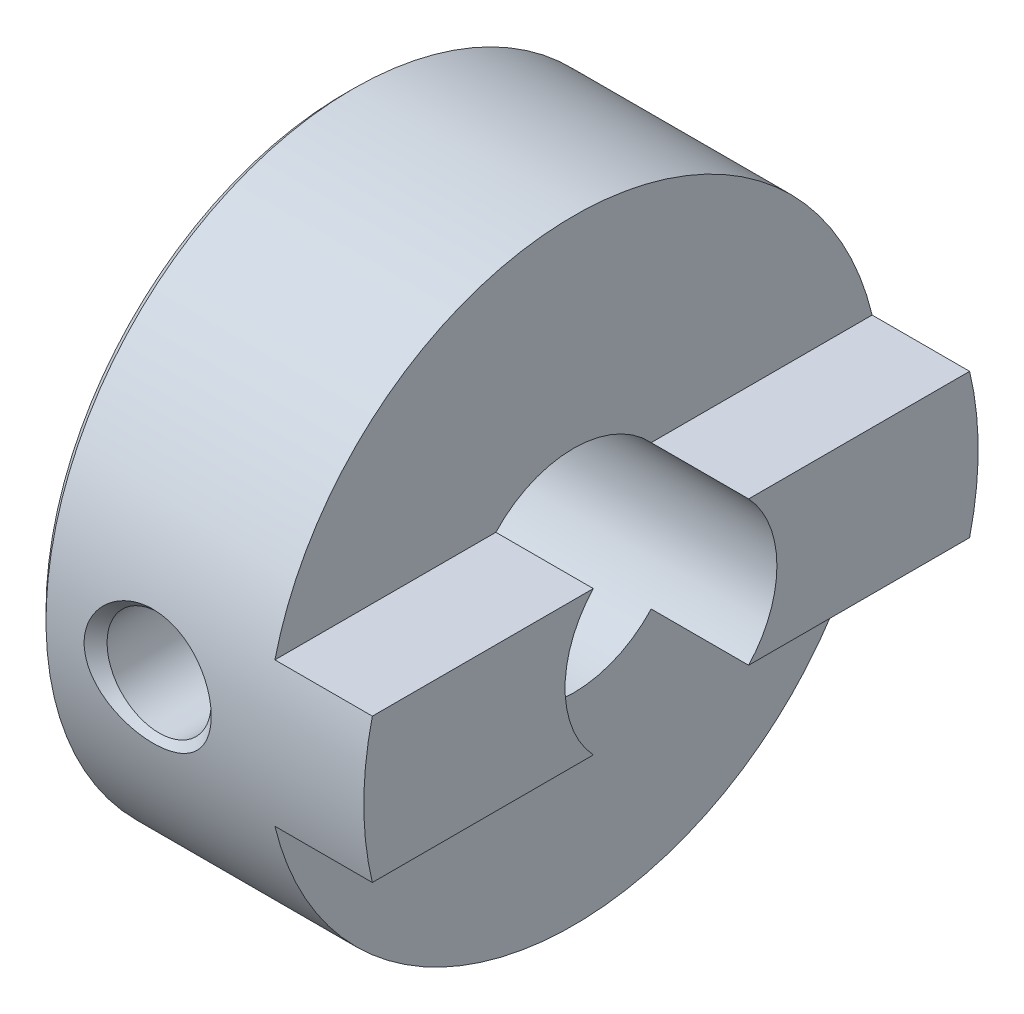
ISO-10303-21;
HEADER;
FILE_DESCRIPTION(('STEP AP214'),'2;1');
FILE_NAME('part.step','',(''),(''),'','','');
FILE_SCHEMA(('AUTOMOTIVE_DESIGN { 1 0 10303 214 1 1 1 1 }'));
ENDSEC;
DATA;
#1=APPLICATION_CONTEXT('core data for automotive mechanical design processes');
#2=APPLICATION_PROTOCOL_DEFINITION('international standard','automotive_design',2000,#1);
#3=PRODUCT_CONTEXT('',#1,'mechanical');
#4=PRODUCT('Part','Part','',(#3));
#5=PRODUCT_RELATED_PRODUCT_CATEGORY('part','',(#4));
#6=PRODUCT_DEFINITION_FORMATION('','',#4);
#7=PRODUCT_DEFINITION_CONTEXT('part definition',#1,'design');
#8=PRODUCT_DEFINITION('design','',#6,#7);
#9=PRODUCT_DEFINITION_SHAPE('','',#8);
#10=(LENGTH_UNIT() NAMED_UNIT(*) SI_UNIT(.MILLI.,.METRE.));
#11=(NAMED_UNIT(*) PLANE_ANGLE_UNIT() SI_UNIT($,.RADIAN.));
#12=(NAMED_UNIT(*) SI_UNIT($,.STERADIAN.) SOLID_ANGLE_UNIT());
#13=UNCERTAINTY_MEASURE_WITH_UNIT(LENGTH_MEASURE(1.E-05),#10,'distance_accuracy_value','');
#14=(GEOMETRIC_REPRESENTATION_CONTEXT(3) GLOBAL_UNCERTAINTY_ASSIGNED_CONTEXT((#13)) GLOBAL_UNIT_ASSIGNED_CONTEXT((#10,
#11,#12)) REPRESENTATION_CONTEXT('',''));
#15=CARTESIAN_POINT('',(0.,0.,0.));
#16=DIRECTION('',(0.,0.,1.));
#17=DIRECTION('',(1.,0.,0.));
#18=AXIS2_PLACEMENT_3D('',#15,#16,#17);
#19=CARTESIAN_POINT('',(-5.4,-7.25162299988824,0.));
#20=DIRECTION('',(0.,-1.,0.));
#21=DIRECTION('',(1.,0.,0.));
#22=AXIS2_PLACEMENT_3D('',#19,#20,#21);
#23=CONICAL_SURFACE('',#22,1.50162299985368,0.785398163397448);
#24=CARTESIAN_POINT('',(-5.4,-6.9795,0.));
#25=DIRECTION('',(0.,1.,0.));
#26=DIRECTION('',(0.,0.,1.));
#27=AXIS2_PLACEMENT_3D('',#24,#25,#26);
#28=CIRCLE('',#27,1.2295);
#29=CARTESIAN_POINT('',(-5.4,-6.9795,1.2295));
#30=VERTEX_POINT('',#29);
#31=EDGE_CURVE('E91',#30,#30,#28,.T.);
#32=ORIENTED_EDGE('',*,*,#31,.T.);
#33=EDGE_LOOP('',(#32));
#34=FACE_BOUND('',#33,.T.);
#35=CARTESIAN_POINT('',(-6.89999999996704,-7.24999999999612,0.));
#36=CARTESIAN_POINT('',(-6.89999427514195,-7.24999809172362,0.074729136799295));
#37=CARTESIAN_POINT('',(-6.89321712195835,-7.24882959299291,0.149558368551508));
#38=CARTESIAN_POINT('',(-6.86643720370093,-7.24429781560447,0.29682489461497));
#39=CARTESIAN_POINT('',(-6.8464086780923,-7.2409302621728,0.369257240849809));
#40=CARTESIAN_POINT('',(-6.79594187660678,-7.23271440670023,0.504603303096781));
#41=CARTESIAN_POINT('',(-6.76631411268736,-7.22798384900006,0.567829063033798));
#42=CARTESIAN_POINT('',(-6.69763255041027,-7.21746357544799,0.688772984074372));
#43=CARTESIAN_POINT('',(-6.65858236062102,-7.21167426527847,0.746493241876688));
#44=CARTESIAN_POINT('',(-6.56920706563387,-7.19913265249924,0.859327471027159));
#45=CARTESIAN_POINT('',(-6.51827172630526,-7.1923410062803,0.913952871674547));
#46=CARTESIAN_POINT('',(-6.40861244759575,-7.17881426122209,1.01475039384936));
#47=CARTESIAN_POINT('',(-6.34988399057378,-7.17207919760997,1.06091757494));
#48=CARTESIAN_POINT('',(-6.22042778848732,-7.1586833747832,1.14798722867465));
#49=CARTESIAN_POINT('',(-6.14909167557422,-7.15208825193543,1.18799583369448));
#50=CARTESIAN_POINT('',(-6.00097820192063,-7.14038471197252,1.25642977973731));
#51=CARTESIAN_POINT('',(-5.92420132917286,-7.13527616173303,1.2848561580538));
#52=CARTESIAN_POINT('',(-5.77338159558941,-7.12737961387078,1.32793042323197));
#53=CARTESIAN_POINT('',(-5.69960612631625,-7.12443949984495,1.34349354595118));
#54=CARTESIAN_POINT('',(-5.55056066467209,-7.12048987418933,1.36427068473236));
#55=CARTESIAN_POINT('',(-5.47529048882883,-7.11948060106506,1.36948342227467));
#56=CARTESIAN_POINT('',(-5.3101149363232,-7.11948303738958,1.36947966923089));
#57=CARTESIAN_POINT('',(-5.2202009213119,-7.12092442501209,1.36204566987992));
#58=CARTESIAN_POINT('',(-5.04287949933168,-7.12652468160578,1.33242904087197));
#59=CARTESIAN_POINT('',(-4.95547352984273,-7.13068507772891,1.31023812275577));
#60=CARTESIAN_POINT('',(-4.78585696916775,-7.14122143164962,1.25153559814614));
#61=CARTESIAN_POINT('',(-4.70364000461483,-7.14759460646495,1.21504197258602));
#62=CARTESIAN_POINT('',(-4.5468684931391,-7.16178399013377,1.12839229867867));
#63=CARTESIAN_POINT('',(-4.47231262833878,-7.16959995014743,1.07823860560033));
#64=CARTESIAN_POINT('',(-4.33587265709758,-7.18540792779988,0.967183850149363));
#65=CARTESIAN_POINT('',(-4.27364501675,-7.19338502808793,0.906704095517562));
#66=CARTESIAN_POINT('',(-4.16131989977743,-7.2087358376494,0.775233649090718));
#67=CARTESIAN_POINT('',(-4.11122020538928,-7.21610965707758,0.704244882846192));
#68=CARTESIAN_POINT('',(-4.02914184408736,-7.2286779661264,0.559933950232655));
#69=CARTESIAN_POINT('',(-3.99601885864382,-7.23400111490471,0.487273801720795));
#70=CARTESIAN_POINT('',(-3.94385602612465,-7.24254791022066,0.337061433975747));
#71=CARTESIAN_POINT('',(-3.92477687513079,-7.24577741311254,0.259523532081522));
#72=CARTESIAN_POINT('',(-3.90883028141449,-7.24848976641585,0.15101648024268));
#73=CARTESIAN_POINT('',(-3.90552380614384,-7.24905444154122,0.120917686555661));
#74=CARTESIAN_POINT('',(-3.9011074112212,-7.24980996103482,0.0605514175098927));
#75=CARTESIAN_POINT('',(-3.89999768005297,-7.25000077332507,0.0302839279002079));
#76=CARTESIAN_POINT('',(-3.90000572486061,-7.24999809172988,-0.0747291367994649));
#77=CARTESIAN_POINT('',(-3.90678287804236,-7.24882959299458,-0.149558368551713));
#78=CARTESIAN_POINT('',(-3.93356279629843,-7.24429781560278,-0.296824894615124));
#79=CARTESIAN_POINT('',(-3.95359132190755,-7.24093026217236,-0.36925724084988));
#80=CARTESIAN_POINT('',(-4.00405812339338,-7.23271440670064,-0.504603303096753));
#81=CARTESIAN_POINT('',(-4.03368588731266,-7.22798384900017,-0.56782906303375));
#82=CARTESIAN_POINT('',(-4.10236744958966,-7.21746357544789,-0.68877298407433));
#83=CARTESIAN_POINT('',(-4.14141763937896,-7.21167426527844,-0.746493241876667));
#84=CARTESIAN_POINT('',(-4.23079293436615,-7.19913265249927,-0.859327471027168));
#85=CARTESIAN_POINT('',(-4.28172827369476,-7.19234100628031,-0.913952871674564));
#86=CARTESIAN_POINT('',(-4.39138755240427,-7.17881426122208,-1.01475039384937));
#87=CARTESIAN_POINT('',(-4.45011600942623,-7.17207919760996,-1.06091757494001));
#88=CARTESIAN_POINT('',(-4.57957221151267,-7.1586833747832,-1.14798722867464));
#89=CARTESIAN_POINT('',(-4.65090832442577,-7.15208825193543,-1.18799583369447));
#90=CARTESIAN_POINT('',(-4.79902179807936,-7.14038471197252,-1.25642977973731));
#91=CARTESIAN_POINT('',(-4.87579867082713,-7.13527616173303,-1.2848561580538));
#92=CARTESIAN_POINT('',(-5.02661840441059,-7.12737961387078,-1.32793042323197));
#93=CARTESIAN_POINT('',(-5.10039387368375,-7.12443949984495,-1.34349354595118));
#94=CARTESIAN_POINT('',(-5.24943933532791,-7.12048987418933,-1.36427068473236));
#95=CARTESIAN_POINT('',(-5.32470951117117,-7.11948060106506,-1.36948342227467));
#96=CARTESIAN_POINT('',(-5.48988506367681,-7.11948303738958,-1.36947966923089));
#97=CARTESIAN_POINT('',(-5.57979907868811,-7.12092442501209,-1.36204566987992));
#98=CARTESIAN_POINT('',(-5.75712050066832,-7.12652468160578,-1.33242904087197));
#99=CARTESIAN_POINT('',(-5.84452647015727,-7.13068507772891,-1.31023812275577));
#100=CARTESIAN_POINT('',(-6.01414303083224,-7.14122143164962,-1.25153559814615));
#101=CARTESIAN_POINT('',(-6.09635999538516,-7.14759460646495,-1.21504197258603));
#102=CARTESIAN_POINT('',(-6.25313150686088,-7.16178399013377,-1.12839229867868));
#103=CARTESIAN_POINT('',(-6.32768737166122,-7.16959995014742,-1.07823860560034));
#104=CARTESIAN_POINT('',(-6.46412734290244,-7.18540792779988,-0.967183850149348));
#105=CARTESIAN_POINT('',(-6.52635498325003,-7.19338502808795,-0.906704095517529));
#106=CARTESIAN_POINT('',(-6.63868010022261,-7.20873583764939,-0.775233649090679));
#107=CARTESIAN_POINT('',(-6.68877979461076,-7.21610965707752,-0.704244882846172));
#108=CARTESIAN_POINT('',(-6.7708581559126,-7.22867796612646,-0.559933950232683));
#109=CARTESIAN_POINT('',(-6.80398114135606,-7.23400111490492,-0.487273801720852));
#110=CARTESIAN_POINT('',(-6.85614397387542,-7.24254791022044,-0.337061433975811));
#111=CARTESIAN_POINT('',(-6.87522312486953,-7.24577741311174,-0.259523532081559));
#112=CARTESIAN_POINT('',(-6.89116971858538,-7.24848976641615,-0.151016480242687));
#113=CARTESIAN_POINT('',(-6.89447619385583,-7.24905444154202,-0.120917686555674));
#114=CARTESIAN_POINT('',(-6.89889258877912,-7.24980996103401,-0.0605514175099498));
#115=CARTESIAN_POINT('',(-6.90000231994822,-7.25000077332216,-0.0302839279003036));
#116=CARTESIAN_POINT('',(-6.89999999996704,-7.24999999999612,0.));
#117=B_SPLINE_CURVE_WITH_KNOTS('',3,(#35,#36,#37,#38,#39,#40,#41,#42,#43,#44,#45,#46,#47,#48,
#49,#50,#51,#52,#53,#54,#55,#56,#57,#58,#59,#60,#61,#62,#63,#64,#65,#66,#67,#68,#69,#70,#71,#72,
#73,#74,#75,#76,#77,#78,#79,#80,#81,#82,#83,#84,#85,#86,#87,#88,#89,#90,#91,#92,#93,#94,#95,#96,
#97,#98,#99,#100,#101,#102,#103,#104,#105,#106,#107,#108,#109,#110,#111,#112,#113,#114,#115,
#116),.UNSPECIFIED.,.T.,.F.,(4,2,2,2,2,2,2,2,2,2,2,2,2,2,2,2,2,2,2,2,2,2,2,2,2,2,2,2,2,2,2,2,2,
2,2,2,2,2,2,2,4),(0.,0.224055146580424,0.44854713893767,0.657602313094672,0.86657755073939,
1.0906314460025,1.31481579654558,1.55992930631012,1.80502085910826,2.03064066577785,
2.25628834014629,2.52567635840238,2.79521581068308,3.06441748745457,3.33357277782344,
3.59361636116128,3.85361235594045,4.09241268280946,4.3305421209466,4.42133251522583,
4.51213069911176,4.73618584569219,4.96067783804921,5.16973301220614,5.37870824985093,
5.60276214511408,5.82694649565712,6.07206000542165,6.3171515582198,6.5427713648894,
6.76841903925783,7.03780705751393,7.30734650979463,7.57654818656609,7.84570347693499,
8.10574706027289,8.36574305505199,8.60454338192091,8.84267282005815,8.93346321433735,
9.02426139822321),.UNSPECIFIED.);
#118=CARTESIAN_POINT('',(-6.89999999996704,-7.24999999999612,0.));
#119=VERTEX_POINT('',#118);
#120=EDGE_CURVE('E102',#119,#119,#117,.T.);
#121=ORIENTED_EDGE('',*,*,#120,.F.);
#122=EDGE_LOOP('',(#121));
#123=FACE_BOUND('',#122,.T.);
#124=ADVANCED_FACE('F17',(#34,#123),#23,.F.);
#125=CARTESIAN_POINT('',(-5.4,0.,7.25162300000193));
#126=DIRECTION('',(0.,0.,1.));
#127=DIRECTION('',(1.,0.,0.));
#128=AXIS2_PLACEMENT_3D('',#125,#126,#127);
#129=CONICAL_SURFACE('',#128,1.50162299996737,0.785398163397448);
#130=CARTESIAN_POINT('',(-5.4,1.3694817115595,7.1194817115895));
#131=CARTESIAN_POINT('',(-5.31011493632329,1.36947966923205,7.11948303738581));
#132=CARTESIAN_POINT('',(-5.2202009213121,1.36204566988025,7.12092442501107));
#133=CARTESIAN_POINT('',(-5.04287949933191,1.33242904087172,7.12652468160678));
#134=CARTESIAN_POINT('',(-4.95547352984289,1.31023812275574,7.13068507772917));
#135=CARTESIAN_POINT('',(-4.78585696916784,1.25153559814627,7.14122143164934));
#136=CARTESIAN_POINT('',(-4.70364000461492,1.21504197258609,7.14759460646487));
#137=CARTESIAN_POINT('',(-4.54686849313922,1.12839229867872,7.16178399013383));
#138=CARTESIAN_POINT('',(-4.47231262833893,1.07823860560043,7.16959995014743));
#139=CARTESIAN_POINT('',(-4.33587265709775,0.967183850149525,7.18540792779984));
#140=CARTESIAN_POINT('',(-4.27364501675016,0.906704095517729,7.19338502808791));
#141=CARTESIAN_POINT('',(-4.16131989977756,0.775233649090897,7.20873583764938));
#142=CARTESIAN_POINT('',(-4.11122020538939,0.704244882846379,7.21610965707754));
#143=CARTESIAN_POINT('',(-4.02914184408747,0.559933950232861,7.22867796612641));
#144=CARTESIAN_POINT('',(-3.99601885864395,0.487273801721014,7.23400111490479));
#145=CARTESIAN_POINT('',(-3.94385602612468,0.33706143397597,7.24254791022055));
#146=CARTESIAN_POINT('',(-3.92477687513069,0.259523532081735,7.24577741311216));
#147=CARTESIAN_POINT('',(-3.90883028141457,0.15101648024286,7.24848976641599));
#148=CARTESIAN_POINT('',(-3.905523806144,0.120917686555825,7.24905444154159));
#149=CARTESIAN_POINT('',(-3.90110741122106,0.060551417510036,7.24980996103444));
#150=CARTESIAN_POINT('',(-3.89999768005243,0.0302839279003479,7.25000077332373));
#151=CARTESIAN_POINT('',(-3.90000572485944,-0.0747291367994341,7.24999809172699));
#152=CARTESIAN_POINT('',(-3.90678287804205,-0.149558368551789,7.24882959299381));
#153=CARTESIAN_POINT('',(-3.93356279629881,-0.296824894615455,7.24429781560355));
#154=CARTESIAN_POINT('',(-3.95359132190777,-0.369257240850359,7.24093026217254));
#155=CARTESIAN_POINT('',(-4.00405812339357,-0.504603303097355,7.23271440670041));
#156=CARTESIAN_POINT('',(-4.03368588731293,-0.567829063034339,7.22798384900008));
#157=CARTESIAN_POINT('',(-4.10236744959003,-0.688772984074875,7.21746357544789));
#158=CARTESIAN_POINT('',(-4.14141763937933,-0.746493241877182,7.2116742652784));
#159=CARTESIAN_POINT('',(-4.23079293436656,-0.859327471027642,7.1991326524992));
#160=CARTESIAN_POINT('',(-4.28172827369521,-0.913952871675023,7.19234100628025));
#161=CARTESIAN_POINT('',(-4.39138755240478,-1.0147503938498,7.17881426122202));
#162=CARTESIAN_POINT('',(-4.45011600942677,-1.06091757494042,7.17207919760989));
#163=CARTESIAN_POINT('',(-4.57957221151325,-1.14798722867498,7.15868337478317));
#164=CARTESIAN_POINT('',(-4.65090832442635,-1.18799583369476,7.15208825193545));
#165=CARTESIAN_POINT('',(-4.79902179807998,-1.25642977973758,7.1403847119724));
#166=CARTESIAN_POINT('',(-4.8757986708278,-1.28485615805411,7.13527616173273));
#167=CARTESIAN_POINT('',(-5.02661840441125,-1.32793042323204,7.12737961387099));
#168=CARTESIAN_POINT('',(-5.10039387368436,-1.34349354595102,7.1244394998458));
#169=CARTESIAN_POINT('',(-5.24943933532829,-1.36427068473265,7.12048987418846));
#170=CARTESIAN_POINT('',(-5.32470951117136,-1.36948342227566,7.11948060106181));
#171=CARTESIAN_POINT('',(-5.4898850636767,-1.36947966923205,7.11948303738581));
#172=CARTESIAN_POINT('',(-5.5797990786879,-1.36204566988025,7.12092442501107));
#173=CARTESIAN_POINT('',(-5.75712050066809,-1.33242904087172,7.12652468160678));
#174=CARTESIAN_POINT('',(-5.84452647015711,-1.31023812275574,7.13068507772917));
#175=CARTESIAN_POINT('',(-6.01414303083216,-1.25153559814626,7.14122143164934));
#176=CARTESIAN_POINT('',(-6.09635999538509,-1.21504197258608,7.14759460646487));
#177=CARTESIAN_POINT('',(-6.25313150686079,-1.12839229867872,7.16178399013383));
#178=CARTESIAN_POINT('',(-6.32768737166108,-1.07823860560043,7.16959995014743));
#179=CARTESIAN_POINT('',(-6.46412734290224,-0.96718385014953,7.18540792779984));
#180=CARTESIAN_POINT('',(-6.52635498324983,-0.906704095517742,7.1933850280879));
#181=CARTESIAN_POINT('',(-6.63868010022243,-0.775233649090913,7.20873583764939));
#182=CARTESIAN_POINT('',(-6.6887797946106,-0.704244882846387,7.21610965707757));
#183=CARTESIAN_POINT('',(-6.77085815591255,-0.559933950232847,7.22867796612639));
#184=CARTESIAN_POINT('',(-6.8039811413561,-0.487273801720987,7.2340011149047));
#185=CARTESIAN_POINT('',(-6.85614397387529,-0.33706143397594,7.24254791022065));
#186=CARTESIAN_POINT('',(-6.87522312486917,-0.259523532081717,7.24577741311253));
#187=CARTESIAN_POINT('',(-6.89116971858549,-0.151016480242855,7.24848976641585));
#188=CARTESIAN_POINT('',(-6.89447619385615,-0.120917686555817,7.24905444154122));
#189=CARTESIAN_POINT('',(-6.89889258877879,-0.0605514175100072,7.24980996103482));
#190=CARTESIAN_POINT('',(-6.90000231994703,-0.0302839279003014,7.25000077332507));
#191=CARTESIAN_POINT('',(-6.8999942751394,0.0747291367995142,7.24999809172988));
#192=CARTESIAN_POINT('',(-6.89321712195763,0.149558368551885,7.24882959299458));
#193=CARTESIAN_POINT('',(-6.86643720370148,0.296824894615529,7.24429781560277));
#194=CARTESIAN_POINT('',(-6.8464086780923,0.369257240850394,7.24093026217234));
#195=CARTESIAN_POINT('',(-6.79594187660636,0.504603303097346,7.2327144067006));
#196=CARTESIAN_POINT('',(-6.76631411268706,0.56782906303432,7.22798384900013));
#197=CARTESIAN_POINT('',(-6.69763255041001,0.688772984074858,7.21746357544784));
#198=CARTESIAN_POINT('',(-6.65858236062068,0.746493241877176,7.21167426527839));
#199=CARTESIAN_POINT('',(-6.56920706563343,0.859327471027649,7.19913265249921));
#200=CARTESIAN_POINT('',(-6.51827172630478,0.913952871675035,7.19234100628025));
#201=CARTESIAN_POINT('',(-6.40861244759521,1.01475039384981,7.17881426122201));
#202=CARTESIAN_POINT('',(-6.34988399057323,1.06091757494042,7.17207919760989));
#203=CARTESIAN_POINT('',(-6.22042778848675,1.14798722867498,7.15868337478317));
#204=CARTESIAN_POINT('',(-6.14909167557365,1.18799583369476,7.15208825193545));
#205=CARTESIAN_POINT('',(-6.00097820192002,1.25642977973758,7.1403847119724));
#206=CARTESIAN_POINT('',(-5.9242013291722,1.28485615805411,7.13527616173273));
#207=CARTESIAN_POINT('',(-5.77338159558875,1.32793042323205,7.12737961387099));
#208=CARTESIAN_POINT('',(-5.69960612631564,1.34349354595102,7.1244394998458));
#209=CARTESIAN_POINT('',(-5.55056066467171,1.36427068473266,7.12048987418846));
#210=CARTESIAN_POINT('',(-5.47529048882864,1.36948342227566,7.11948060106181));
#211=CARTESIAN_POINT('',(-5.4,1.3694817115595,7.1194817115895));
#212=B_SPLINE_CURVE_WITH_KNOTS('',3,(#130,#131,#132,#133,#134,#135,#136,#137,#138,#139,#140,
#141,#142,#143,#144,#145,#146,#147,#148,#149,#150,#151,#152,#153,#154,#155,#156,#157,#158,#159,
#160,#161,#162,#163,#164,#165,#166,#167,#168,#169,#170,#171,#172,#173,#174,#175,#176,#177,#178,
#179,#180,#181,#182,#183,#184,#185,#186,#187,#188,#189,#190,#191,#192,#193,#194,#195,#196,#197,
#198,#199,#200,#201,#202,#203,#204,#205,#206,#207,#208,#209,#210,#211),.UNSPECIFIED.,.T.,.F.,(4,
2,2,2,2,2,2,2,2,2,2,2,2,2,2,2,2,2,2,2,2,2,2,2,2,2,2,2,2,2,2,2,2,2,2,2,2,2,2,2,4),(0.,
0.26938801825597,0.538927470536824,0.808129147308331,1.07728443767707,1.33732802101491,
1.59732401579408,1.83612434266307,2.07425378080026,2.16504417507954,2.2558423589655,
2.47989750554629,2.70438949790377,2.91344467206071,3.12241990970546,3.34647380496865,
3.57065815551171,3.8157716652762,4.06086321807445,4.28648302474383,4.51213069911186,
4.78151871736783,5.05105816964869,5.32025984642021,5.58941513678893,5.84945872012674,
6.10945471490594,6.34825504177498,6.58638447991212,6.67717487419141,6.76797305807741,
6.9920282046582,7.21652019701558,7.42557537117249,7.63455060881727,7.85860450408047,
8.08278885462352,8.327902364388,8.57299391718626,8.79861372385564,9.02426139822367),.UNSPECIFIED.);
#213=CARTESIAN_POINT('',(-5.4,1.3694817115595,7.1194817115895));
#214=VERTEX_POINT('',#213);
#215=EDGE_CURVE('E173',#214,#214,#212,.T.);
#216=ORIENTED_EDGE('',*,*,#215,.F.);
#217=EDGE_LOOP('',(#216));
#218=FACE_BOUND('',#217,.T.);
#219=CARTESIAN_POINT('',(-5.4,0.,6.9795));
#220=DIRECTION('',(0.,0.,-1.));
#221=DIRECTION('',(-1.,0.,0.));
#222=AXIS2_PLACEMENT_3D('',#219,#220,#221);
#223=CIRCLE('',#222,1.2295);
#224=CARTESIAN_POINT('',(-6.6295,0.,6.9795));
#225=VERTEX_POINT('',#224);
#226=EDGE_CURVE('E109',#225,#225,#223,.T.);
#227=ORIENTED_EDGE('',*,*,#226,.T.);
#228=EDGE_LOOP('',(#227));
#229=FACE_BOUND('',#228,.T.);
#230=ADVANCED_FACE('F168',(#218,#229),#129,.F.);
#231=CARTESIAN_POINT('',(-0.3,1.7,7.25));
#232=DIRECTION('',(0.,-1.,0.));
#233=DIRECTION('',(0.,0.,-1.));
#234=AXIS2_PLACEMENT_3D('',#231,#232,#233);
#235=PLANE('',#234);
#236=DIRECTION('',(0.,0.,-1.));
#237=VECTOR('',#236,1.);
#238=CARTESIAN_POINT('',(-2.6,1.7,0.));
#239=LINE('',#238,#237);
#240=CARTESIAN_POINT('',(-2.6,1.7,-1.83303027798234));
#241=VERTEX_POINT('',#240);
#242=CARTESIAN_POINT('',(-2.6,1.7,-7.04787201926936));
#243=VERTEX_POINT('',#242);
#244=EDGE_CURVE('E112',#241,#243,#239,.T.);
#245=ORIENTED_EDGE('',*,*,#244,.F.);
#246=DIRECTION('',(1.,0.,0.));
#247=VECTOR('',#246,1.);
#248=CARTESIAN_POINT('',(-4.15,1.7,-1.83303027798234));
#249=LINE('',#248,#247);
#250=CARTESIAN_POINT('',(-0.3,1.7,-1.83303027798234));
#251=VERTEX_POINT('',#250);
#252=EDGE_CURVE('E178',#241,#251,#249,.T.);
#253=ORIENTED_EDGE('',*,*,#252,.T.);
#254=DIRECTION('',(0.,0.,-1.));
#255=VECTOR('',#254,1.);
#256=CARTESIAN_POINT('',(-0.3,1.7,0.));
#257=LINE('',#256,#255);
#258=CARTESIAN_POINT('',(-0.3,1.7,-7.04787201926936));
#259=VERTEX_POINT('',#258);
#260=EDGE_CURVE('E92',#259,#251,#257,.F.);
#261=ORIENTED_EDGE('',*,*,#260,.F.);
#262=DIRECTION('',(1.,0.,0.));
#263=VECTOR('',#262,1.);
#264=CARTESIAN_POINT('',(-4.05,1.7,-7.04787201926936));
#265=LINE('',#264,#263);
#266=EDGE_CURVE('E108',#243,#259,#265,.T.);
#267=ORIENTED_EDGE('',*,*,#266,.F.);
#268=EDGE_LOOP('',(#245,#253,#261,#267));
#269=FACE_BOUND('',#268,.T.);
#270=ADVANCED_FACE('F166',(#269),#235,.F.);
#271=CARTESIAN_POINT('',(-0.3,4.875,0.));
#272=DIRECTION('',(1.,0.,0.));
#273=DIRECTION('',(0.,0.,-1.));
#274=AXIS2_PLACEMENT_3D('',#271,#272,#273);
#275=PLANE('',#274);
#276=ORIENTED_EDGE('',*,*,#260,.T.);
#277=CARTESIAN_POINT('',(-0.3,0.,0.));
#278=DIRECTION('',(1.,0.,0.));
#279=DIRECTION('',(0.,0.,-1.));
#280=AXIS2_PLACEMENT_3D('',#277,#278,#279);
#281=CIRCLE('',#280,2.5);
#282=CARTESIAN_POINT('',(-0.3,-1.7,-1.83303027798234));
#283=VERTEX_POINT('',#282);
#284=EDGE_CURVE('E87',#251,#283,#281,.F.);
#285=ORIENTED_EDGE('',*,*,#284,.T.);
#286=DIRECTION('',(0.,0.,1.));
#287=VECTOR('',#286,1.);
#288=CARTESIAN_POINT('',(-0.3,-1.7,-7.25));
#289=LINE('',#288,#287);
#290=CARTESIAN_POINT('',(-0.3,-1.7,-7.04787201926936));
#291=VERTEX_POINT('',#290);
#292=EDGE_CURVE('E80',#283,#291,#289,.F.);
#293=ORIENTED_EDGE('',*,*,#292,.T.);
#294=CARTESIAN_POINT('',(-0.3,0.,0.));
#295=DIRECTION('',(1.,0.,0.));
#296=DIRECTION('',(0.,0.,-1.));
#297=AXIS2_PLACEMENT_3D('',#294,#295,#296);
#298=CIRCLE('',#297,7.25);
#299=EDGE_CURVE('E21',#259,#291,#298,.F.);
#300=ORIENTED_EDGE('',*,*,#299,.F.);
#301=EDGE_LOOP('',(#276,#285,#293,#300));
#302=FACE_BOUND('',#301,.T.);
#303=ADVANCED_FACE('F83',(#302),#275,.T.);
#304=CARTESIAN_POINT('',(-0.3,-1.7,-7.25));
#305=DIRECTION('',(0.,1.,0.));
#306=DIRECTION('',(0.,0.,1.));
#307=AXIS2_PLACEMENT_3D('',#304,#305,#306);
#308=PLANE('',#307);
#309=ORIENTED_EDGE('',*,*,#292,.F.);
#310=DIRECTION('',(1.,0.,0.));
#311=VECTOR('',#310,1.);
#312=CARTESIAN_POINT('',(-4.15,-1.7,-1.83303027798234));
#313=LINE('',#312,#311);
#314=CARTESIAN_POINT('',(-2.6,-1.7,-1.83303027798234));
#315=VERTEX_POINT('',#314);
#316=EDGE_CURVE('E152',#283,#315,#313,.F.);
#317=ORIENTED_EDGE('',*,*,#316,.T.);
#318=DIRECTION('',(0.,0.,-1.));
#319=VECTOR('',#318,1.);
#320=CARTESIAN_POINT('',(-2.6,-1.7,0.));
#321=LINE('',#320,#319);
#322=CARTESIAN_POINT('',(-2.6,-1.7,-7.04787201926936));
#323=VERTEX_POINT('',#322);
#324=EDGE_CURVE('E99',#323,#315,#321,.F.);
#325=ORIENTED_EDGE('',*,*,#324,.F.);
#326=DIRECTION('',(1.,0.,0.));
#327=VECTOR('',#326,1.);
#328=CARTESIAN_POINT('',(-4.05,-1.70000000000001,-7.04787201926936));
#329=LINE('',#328,#327);
#330=EDGE_CURVE('E96',#291,#323,#329,.F.);
#331=ORIENTED_EDGE('',*,*,#330,.F.);
#332=EDGE_LOOP('',(#309,#317,#325,#331));
#333=FACE_BOUND('',#332,.T.);
#334=ADVANCED_FACE('F97',(#333),#308,.F.);
#335=CARTESIAN_POINT('',(-5.4,-3.48975,0.));
#336=DIRECTION('',(0.,1.,0.));
#337=DIRECTION('',(0.,0.,1.));
#338=AXIS2_PLACEMENT_3D('',#335,#336,#337);
#339=CYLINDRICAL_SURFACE('',#338,1.2295);
#340=CARTESIAN_POINT('',(-6.6295,-2.5,0.));
#341=CARTESIAN_POINT('',(-6.62949819333798,-2.49999838825443,0.0648450068083129));
#342=CARTESIAN_POINT('',(-6.6243462310223,-2.49745315506252,0.129707191169774));
#343=CARTESIAN_POINT('',(-6.60398206741825,-2.48753403936365,0.257465486125666));
#344=CARTESIAN_POINT('',(-6.58876368827183,-2.48015719167513,0.320360364525517));
#345=CARTESIAN_POINT('',(-6.54900092059468,-2.46134686623753,0.442225804413261));
#346=CARTESIAN_POINT('',(-6.52448728385969,-2.4499267730579,0.501208560550219));
#347=CARTESIAN_POINT('',(-6.46700410818799,-2.42408117953334,0.614159755287785));
#348=CARTESIAN_POINT('',(-6.43403302641294,-2.40965513092113,0.6681272765411));
#349=CARTESIAN_POINT('',(-6.35836197978969,-2.3781369445546,0.77307254685801));
#350=CARTESIAN_POINT('',(-6.31520332271644,-2.36093781376284,0.823686902314883));
#351=CARTESIAN_POINT('',(-6.22136208541062,-2.32616986847797,0.917296035341809));
#352=CARTESIAN_POINT('',(-6.17067358153404,-2.30860077236184,0.960284754958348));
#353=CARTESIAN_POINT('',(-6.05867173933629,-2.2735747453594,1.04063442608388));
#354=CARTESIAN_POINT('',(-5.99684738021329,-2.25622440286172,1.07733434301526));
#355=CARTESIAN_POINT('',(-5.86698146718537,-2.22541042617205,1.1396341340246));
#356=CARTESIAN_POINT('',(-5.79894903094585,-2.21194120907837,1.16524997916135));
#357=CARTESIAN_POINT('',(-5.67566592462731,-2.19352626707861,1.19946698540809));
#358=CARTESIAN_POINT('',(-5.6213255411865,-2.18730477408956,1.21068990141446));
#359=CARTESIAN_POINT('',(-5.51132736744806,-2.17892666237578,1.22570560116341));
#360=CARTESIAN_POINT('',(-5.45567019230943,-2.17676818209169,1.22950178765815));
#361=CARTESIAN_POINT('',(-5.33569039566273,-2.1767731480833,1.22949793491663));
#362=CARTESIAN_POINT('',(-5.27136342040483,-2.17965929479749,1.2244276174073));
#363=CARTESIAN_POINT('',(-5.1447215334919,-2.19077658023041,1.20441783892439));
#364=CARTESIAN_POINT('',(-5.08240840235038,-2.19901231995407,1.18946988233408));
#365=CARTESIAN_POINT('',(-4.96178561694019,-2.21964830088318,1.150495582666));
#366=CARTESIAN_POINT('',(-4.90345881413092,-2.23202914793571,1.12651145377649));
#367=CARTESIAN_POINT('',(-4.79165350664795,-2.25952913201324,1.07028262367521));
#368=CARTESIAN_POINT('',(-4.73817638923359,-2.27464904886868,1.03803556886994));
#369=CARTESIAN_POINT('',(-4.63291070999793,-2.30739154872425,0.963192369004));
#370=CARTESIAN_POINT('',(-4.58159416181889,-2.32511752993864,0.919977391045806));
#371=CARTESIAN_POINT('',(-4.48656776150495,-2.36024074090601,0.825708112710582));
#372=CARTESIAN_POINT('',(-4.44286208124121,-2.3776377857256,0.774649541573774));
#373=CARTESIAN_POINT('',(-4.36152525056811,-2.41149400716273,0.662093265646122));
#374=CARTESIAN_POINT('',(-4.32447387107132,-2.42781864635637,0.600132652366459));
#375=CARTESIAN_POINT('',(-4.26155958419735,-2.4563360274001,0.469929578102612));
#376=CARTESIAN_POINT('',(-4.23568226586988,-2.46853408678702,0.401695346737067));
#377=CARTESIAN_POINT('',(-4.20100115455813,-2.48510744630852,0.277800388931353));
#378=CARTESIAN_POINT('',(-4.18959963626926,-2.49065362521221,0.223012316405777));
#379=CARTESIAN_POINT('',(-4.1743492877333,-2.49810011148299,0.112153547557146));
#380=CARTESIAN_POINT('',(-4.17049843745279,-2.50000139396772,0.0560831983442118));
#381=CARTESIAN_POINT('',(-4.17050180666202,-2.49999838825443,-0.0648450068083129));
#382=CARTESIAN_POINT('',(-4.1756537689777,-2.49745315506252,-0.129707191169774));
#383=CARTESIAN_POINT('',(-4.19601793258175,-2.48753403936365,-0.257465486125666));
#384=CARTESIAN_POINT('',(-4.21123631172817,-2.48015719167513,-0.320360364525517));
#385=CARTESIAN_POINT('',(-4.25099907940532,-2.46134686623753,-0.442225804413261));
#386=CARTESIAN_POINT('',(-4.27551271614031,-2.4499267730579,-0.501208560550219));
#387=CARTESIAN_POINT('',(-4.33299589181201,-2.42408117953334,-0.614159755287785));
#388=CARTESIAN_POINT('',(-4.36596697358706,-2.40965513092113,-0.6681272765411));
#389=CARTESIAN_POINT('',(-4.44163802021031,-2.3781369445546,-0.77307254685801));
#390=CARTESIAN_POINT('',(-4.48479667728356,-2.36093781376284,-0.823686902314884));
#391=CARTESIAN_POINT('',(-4.57863791458938,-2.32616986847797,-0.91729603534181));
#392=CARTESIAN_POINT('',(-4.62932641846596,-2.30860077236184,-0.960284754958348));
#393=CARTESIAN_POINT('',(-4.74132826066371,-2.2735747453594,-1.04063442608388));
#394=CARTESIAN_POINT('',(-4.80315261978671,-2.25622440286172,-1.07733434301526));
#395=CARTESIAN_POINT('',(-4.93301853281464,-2.22541042617205,-1.1396341340246));
#396=CARTESIAN_POINT('',(-5.00105096905415,-2.21194120907837,-1.16524997916135));
#397=CARTESIAN_POINT('',(-5.12433407537269,-2.19352626707861,-1.19946698540809));
#398=CARTESIAN_POINT('',(-5.1786744588135,-2.18730477408956,-1.21068990141446));
#399=CARTESIAN_POINT('',(-5.28867263255194,-2.17892666237578,-1.22570560116341));
#400=CARTESIAN_POINT('',(-5.34432980769057,-2.17676818209169,-1.22950178765815));
#401=CARTESIAN_POINT('',(-5.46430960433727,-2.1767731480833,-1.22949793491663));
#402=CARTESIAN_POINT('',(-5.52863657959517,-2.17965929479749,-1.2244276174073));
#403=CARTESIAN_POINT('',(-5.6552784665081,-2.19077658023041,-1.20441783892439));
#404=CARTESIAN_POINT('',(-5.71759159764962,-2.19901231995407,-1.18946988233408));
#405=CARTESIAN_POINT('',(-5.83821438305981,-2.21964830088318,-1.150495582666));
#406=CARTESIAN_POINT('',(-5.89654118586908,-2.23202914793571,-1.12651145377649));
#407=CARTESIAN_POINT('',(-6.00834649335206,-2.25952913201324,-1.07028262367521));
#408=CARTESIAN_POINT('',(-6.06182361076641,-2.27464904886868,-1.03803556886994));
#409=CARTESIAN_POINT('',(-6.16708929000207,-2.30739154872425,-0.963192369003999));
#410=CARTESIAN_POINT('',(-6.21840583818112,-2.32511752993864,-0.919977391045806));
#411=CARTESIAN_POINT('',(-6.31343223849505,-2.36024074090601,-0.825708112710582));
#412=CARTESIAN_POINT('',(-6.35713791875879,-2.3776377857256,-0.774649541573774));
#413=CARTESIAN_POINT('',(-6.43847474943189,-2.41149400716273,-0.662093265646122));
#414=CARTESIAN_POINT('',(-6.47552612892868,-2.42781864635637,-0.60013265236646));
#415=CARTESIAN_POINT('',(-6.53844041580265,-2.4563360274001,-0.469929578102612));
#416=CARTESIAN_POINT('',(-6.56431773413012,-2.46853408678702,-0.401695346737067));
#417=CARTESIAN_POINT('',(-6.59899884544188,-2.48510744630852,-0.277800388931353));
#418=CARTESIAN_POINT('',(-6.61040036373074,-2.49065362521221,-0.223012316405777));
#419=CARTESIAN_POINT('',(-6.6256507122667,-2.49810011148299,-0.112153547557146));
#420=CARTESIAN_POINT('',(-6.62950156254721,-2.50000139396772,-0.0560831983442119));
#421=CARTESIAN_POINT('',(-6.6295,-2.5,0.));
#422=B_SPLINE_CURVE_WITH_KNOTS('',3,(#340,#341,#342,#343,#344,#345,#346,#347,#348,#349,#350,
#351,#352,#353,#354,#355,#356,#357,#358,#359,#360,#361,#362,#363,#364,#365,#366,#367,#368,#369,
#370,#371,#372,#373,#374,#375,#376,#377,#378,#379,#380,#381,#382,#383,#384,#385,#386,#387,#388,
#389,#390,#391,#392,#393,#394,#395,#396,#397,#398,#399,#400,#401,#402,#403,#404,#405,#406,#407,
#408,#409,#410,#411,#412,#413,#414,#415,#416,#417,#418,#419,#420,#421),.UNSPECIFIED.,.T.,.F.,(4,
2,2,2,2,2,2,2,2,2,2,2,2,2,2,2,2,2,2,2,2,2,2,2,2,2,2,2,2,2,2,2,2,2,2,2,2,2,2,2,4),(0.,
0.194318019300706,0.388755404245337,0.582555060155502,0.776390094887741,0.981643492924756,
1.18705922504601,1.40783245417999,1.62828650279263,1.79518099654813,1.96199900526104,
2.15470536555221,2.34757768594555,2.53955992004949,2.73159689885295,2.93889676052243,
3.14630989764607,3.36720965134646,3.58782365819513,3.75593055298007,3.92399246791689,
4.11831048721759,4.31274787216222,4.50654752807239,4.70038256280463,4.90563596084164,
5.11105169296289,5.33182492209687,5.55227897070952,5.71917346446501,5.88599147317793,
6.07869783346909,6.27157015386243,6.46355238796638,6.65558936676984,6.86288922843932,
7.07030236556296,7.29120211926335,7.51181612611202,7.67992302089696,7.84798493583377),.UNSPECIFIED.);
#423=CARTESIAN_POINT('',(-6.6295,-2.5,0.));
#424=VERTEX_POINT('',#423);
#425=EDGE_CURVE('E144',#424,#424,#422,.T.);
#426=ORIENTED_EDGE('',*,*,#425,.T.);
#427=EDGE_LOOP('',(#426));
#428=FACE_BOUND('',#427,.T.);
#429=ORIENTED_EDGE('',*,*,#31,.F.);
#430=EDGE_LOOP('',(#429));
#431=FACE_BOUND('',#430,.T.);
#432=ADVANCED_FACE('F154',(#428,#431),#339,.F.);
#433=CARTESIAN_POINT('',(-2.6,0.,0.));
#434=DIRECTION('',(1.,0.,0.));
#435=DIRECTION('',(0.,0.,-1.));
#436=AXIS2_PLACEMENT_3D('',#433,#434,#435);
#437=PLANE('',#436);
#438=DIRECTION('',(0.,0.,1.));
#439=VECTOR('',#438,1.);
#440=CARTESIAN_POINT('',(-2.6,-1.7,-7.25));
#441=LINE('',#440,#439);
#442=CARTESIAN_POINT('',(-2.6,-1.7,1.83303027798234));
#443=VERTEX_POINT('',#442);
#444=CARTESIAN_POINT('',(-2.6,-1.7,7.04787201926936));
#445=VERTEX_POINT('',#444);
#446=EDGE_CURVE('E227',#443,#445,#441,.T.);
#447=ORIENTED_EDGE('',*,*,#446,.T.);
#448=CARTESIAN_POINT('',(-2.6,0.,0.));
#449=DIRECTION('',(1.,0.,0.));
#450=DIRECTION('',(0.,0.,-1.));
#451=AXIS2_PLACEMENT_3D('',#448,#449,#450);
#452=CIRCLE('',#451,7.25);
#453=EDGE_CURVE('E186',#323,#445,#452,.F.);
#454=ORIENTED_EDGE('',*,*,#453,.F.);
#455=ORIENTED_EDGE('',*,*,#324,.T.);
#456=CARTESIAN_POINT('',(-2.6,0.,0.));
#457=DIRECTION('',(1.,0.,0.));
#458=DIRECTION('',(0.,0.,-1.));
#459=AXIS2_PLACEMENT_3D('',#456,#457,#458);
#460=CIRCLE('',#459,2.5);
#461=EDGE_CURVE('E151',#315,#443,#460,.F.);
#462=ORIENTED_EDGE('',*,*,#461,.T.);
#463=EDGE_LOOP('',(#447,#454,#455,#462));
#464=FACE_BOUND('',#463,.T.);
#465=ADVANCED_FACE('F159',(#464),#437,.T.);
#466=CARTESIAN_POINT('',(-0.3,-1.7,-7.25));
#467=DIRECTION('',(0.,1.,0.));
#468=DIRECTION('',(0.,0.,1.));
#469=AXIS2_PLACEMENT_3D('',#466,#467,#468);
#470=PLANE('',#469);
#471=ORIENTED_EDGE('',*,*,#446,.F.);
#472=DIRECTION('',(1.,0.,0.));
#473=VECTOR('',#472,1.);
#474=CARTESIAN_POINT('',(-4.15,-1.7,1.83303027798234));
#475=LINE('',#474,#473);
#476=CARTESIAN_POINT('',(-0.3,-1.7,1.83303027798234));
#477=VERTEX_POINT('',#476);
#478=EDGE_CURVE('E228',#443,#477,#475,.T.);
#479=ORIENTED_EDGE('',*,*,#478,.T.);
#480=DIRECTION('',(0.,0.,-1.));
#481=VECTOR('',#480,1.);
#482=CARTESIAN_POINT('',(-0.3,-1.7,0.));
#483=LINE('',#482,#481);
#484=CARTESIAN_POINT('',(-0.3,-1.7,7.04787201926936));
#485=VERTEX_POINT('',#484);
#486=EDGE_CURVE('E224',#485,#477,#483,.T.);
#487=ORIENTED_EDGE('',*,*,#486,.F.);
#488=DIRECTION('',(1.,0.,0.));
#489=VECTOR('',#488,1.);
#490=CARTESIAN_POINT('',(-4.05,-1.7,7.04787201926936));
#491=LINE('',#490,#489);
#492=EDGE_CURVE('E185',#445,#485,#491,.T.);
#493=ORIENTED_EDGE('',*,*,#492,.F.);
#494=EDGE_LOOP('',(#471,#479,#487,#493));
#495=FACE_BOUND('',#494,.T.);
#496=ADVANCED_FACE('F240',(#495),#470,.F.);
#497=CARTESIAN_POINT('',(-0.3,4.875,0.));
#498=DIRECTION('',(1.,0.,0.));
#499=DIRECTION('',(0.,0.,-1.));
#500=AXIS2_PLACEMENT_3D('',#497,#498,#499);
#501=PLANE('',#500);
#502=DIRECTION('',(0.,0.,-1.));
#503=VECTOR('',#502,1.);
#504=CARTESIAN_POINT('',(-0.3,1.7,7.25));
#505=LINE('',#504,#503);
#506=CARTESIAN_POINT('',(-0.3,1.7,1.83303027798234));
#507=VERTEX_POINT('',#506);
#508=CARTESIAN_POINT('',(-0.3,1.7,7.04787201926936));
#509=VERTEX_POINT('',#508);
#510=EDGE_CURVE('E220',#507,#509,#505,.F.);
#511=ORIENTED_EDGE('',*,*,#510,.T.);
#512=CARTESIAN_POINT('',(-0.3,0.,0.));
#513=DIRECTION('',(1.,0.,0.));
#514=DIRECTION('',(0.,0.,-1.));
#515=AXIS2_PLACEMENT_3D('',#512,#513,#514);
#516=CIRCLE('',#515,7.25);
#517=EDGE_CURVE('E182',#485,#509,#516,.F.);
#518=ORIENTED_EDGE('',*,*,#517,.F.);
#519=ORIENTED_EDGE('',*,*,#486,.T.);
#520=CARTESIAN_POINT('',(-0.3,0.,0.));
#521=DIRECTION('',(1.,0.,0.));
#522=DIRECTION('',(0.,0.,-1.));
#523=AXIS2_PLACEMENT_3D('',#520,#521,#522);
#524=CIRCLE('',#523,2.5);
#525=EDGE_CURVE('E222',#477,#507,#524,.F.);
#526=ORIENTED_EDGE('',*,*,#525,.T.);
#527=EDGE_LOOP('',(#511,#518,#519,#526));
#528=FACE_BOUND('',#527,.T.);
#529=ADVANCED_FACE('F244',(#528),#501,.T.);
#530=CARTESIAN_POINT('',(-0.3,1.7,7.25));
#531=DIRECTION('',(0.,-1.,0.));
#532=DIRECTION('',(0.,0.,-1.));
#533=AXIS2_PLACEMENT_3D('',#530,#531,#532);
#534=PLANE('',#533);
#535=ORIENTED_EDGE('',*,*,#510,.F.);
#536=DIRECTION('',(1.,0.,0.));
#537=VECTOR('',#536,1.);
#538=CARTESIAN_POINT('',(-4.15,1.7,1.83303027798234));
#539=LINE('',#538,#537);
#540=CARTESIAN_POINT('',(-2.6,1.7,1.83303027798234));
#541=VERTEX_POINT('',#540);
#542=EDGE_CURVE('E36',#507,#541,#539,.F.);
#543=ORIENTED_EDGE('',*,*,#542,.T.);
#544=DIRECTION('',(0.,0.,-1.));
#545=VECTOR('',#544,1.);
#546=CARTESIAN_POINT('',(-2.6,1.7,0.));
#547=LINE('',#546,#545);
#548=CARTESIAN_POINT('',(-2.6,1.7,7.04787201926936));
#549=VERTEX_POINT('',#548);
#550=EDGE_CURVE('E218',#549,#541,#547,.T.);
#551=ORIENTED_EDGE('',*,*,#550,.F.);
#552=DIRECTION('',(1.,0.,0.));
#553=VECTOR('',#552,1.);
#554=CARTESIAN_POINT('',(-4.05,1.7,7.04787201926936));
#555=LINE('',#554,#553);
#556=EDGE_CURVE('E181',#509,#549,#555,.F.);
#557=ORIENTED_EDGE('',*,*,#556,.F.);
#558=EDGE_LOOP('',(#535,#543,#551,#557));
#559=FACE_BOUND('',#558,.T.);
#560=ADVANCED_FACE('F246',(#559),#534,.F.);
#561=CARTESIAN_POINT('',(-2.6,0.,0.));
#562=DIRECTION('',(1.,0.,0.));
#563=DIRECTION('',(0.,0.,-1.));
#564=AXIS2_PLACEMENT_3D('',#561,#562,#563);
#565=PLANE('',#564);
#566=ORIENTED_EDGE('',*,*,#244,.T.);
#567=CARTESIAN_POINT('',(-2.6,0.,0.));
#568=DIRECTION('',(1.,0.,0.));
#569=DIRECTION('',(0.,0.,-1.));
#570=AXIS2_PLACEMENT_3D('',#567,#568,#569);
#571=CIRCLE('',#570,7.25);
#572=EDGE_CURVE('E179',#549,#243,#571,.F.);
#573=ORIENTED_EDGE('',*,*,#572,.F.);
#574=ORIENTED_EDGE('',*,*,#550,.T.);
#575=CARTESIAN_POINT('',(-2.6,0.,0.));
#576=DIRECTION('',(1.,0.,0.));
#577=DIRECTION('',(0.,0.,-1.));
#578=AXIS2_PLACEMENT_3D('',#575,#576,#577);
#579=CIRCLE('',#578,2.5);
#580=EDGE_CURVE('E128',#541,#241,#579,.F.);
#581=ORIENTED_EDGE('',*,*,#580,.T.);
#582=EDGE_LOOP('',(#566,#573,#574,#581));
#583=FACE_BOUND('',#582,.T.);
#584=ADVANCED_FACE('F250',(#583),#565,.T.);
#585=CARTESIAN_POINT('',(-5.4,0.,3.48975));
#586=DIRECTION('',(0.,0.,-1.));
#587=DIRECTION('',(-1.,0.,0.));
#588=AXIS2_PLACEMENT_3D('',#585,#586,#587);
#589=CYLINDRICAL_SURFACE('',#588,1.2295);
#590=ORIENTED_EDGE('',*,*,#226,.F.);
#591=EDGE_LOOP('',(#590));
#592=FACE_BOUND('',#591,.T.);
#593=CARTESIAN_POINT('',(-5.4,-1.2295,2.17677048629386));
#594=CARTESIAN_POINT('',(-5.46428382682939,-1.22949615961132,2.17677529494312));
#595=CARTESIAN_POINT('',(-5.52860743506719,-1.22442918309747,2.1796586944978));
#596=CARTESIAN_POINT('',(-5.65525707190373,-1.20442426413105,2.19077273863722));
#597=CARTESIAN_POINT('',(-5.71758048313481,-1.18947390007878,2.19901011196251));
#598=CARTESIAN_POINT('',(-5.83821522483671,-1.15049488617528,2.21964874996234));
#599=CARTESIAN_POINT('',(-5.89654432257291,-1.12651000859005,2.23202990624664));
#600=CARTESIAN_POINT('',(-6.00834982793534,-1.07028081402437,2.25952996609549));
#601=CARTESIAN_POINT('',(-6.06182512887458,-1.03803461980198,2.27464949167816));
#602=CARTESIAN_POINT('',(-6.16709201625264,-0.963190289993958,2.30739242844545));
#603=CARTESIAN_POINT('',(-6.21841110670527,-0.919972639051331,2.32511934579259));
#604=CARTESIAN_POINT('',(-6.31343669524731,-0.825703216500619,2.36024251949066));
#605=CARTESIAN_POINT('',(-6.35713980050672,-0.774647972291679,2.37763862541035));
#606=CARTESIAN_POINT('',(-6.43846050393077,-0.662111877290117,2.41148801745076));
#607=CARTESIAN_POINT('',(-6.47550128192538,-0.600170165180914,2.42780744263734));
#608=CARTESIAN_POINT('',(-6.53842191993455,-0.469981724462832,2.45632758290061));
#609=CARTESIAN_POINT('',(-6.56430855483222,-0.401738853772963,2.4685307971298));
#610=CARTESIAN_POINT('',(-6.60232958670819,-0.265891660665291,2.48669811514267));
#611=CARTESIAN_POINT('',(-6.61529186103773,-0.198570100838605,2.4930356110144));
#612=CARTESIAN_POINT('',(-6.62981734575782,-0.0624317663159609,2.50014754572379));
#613=CARTESIAN_POINT('',(-6.63138716101461,0.00638411881663772,2.50092520791413));
#614=CARTESIAN_POINT('',(-6.62341469951207,0.137355435222153,2.4970114062431));
#615=CARTESIAN_POINT('',(-6.61479690852073,0.199583807286237,2.49277491815429));
#616=CARTESIAN_POINT('',(-6.58834096770405,0.321577730071173,2.47998997196243));
#617=CARTESIAN_POINT('',(-6.57050216212959,0.381343105310479,2.47144120719443));
#618=CARTESIAN_POINT('',(-6.52598040465918,0.497775579972127,2.45066719640992));
#619=CARTESIAN_POINT('',(-6.49917563009603,0.554386728926683,2.43839153698959));
#620=CARTESIAN_POINT('',(-6.43764412722263,0.662446179590555,2.41128037732784));
#621=CARTESIAN_POINT('',(-6.40291467398889,0.713892696644056,2.39644399700366));
#622=CARTESIAN_POINT('',(-6.32283913995953,0.815220002344013,2.36400096404851));
#623=CARTESIAN_POINT('',(-6.27680970606826,0.864519801194203,2.34626501627735));
#624=CARTESIAN_POINT('',(-6.17726534171245,0.955017706773573,2.31091044578807));
#625=CARTESIAN_POINT('',(-6.1237436461137,0.996208409600606,2.29329194435007));
#626=CARTESIAN_POINT('',(-6.00678376167474,1.07173610238655,2.25902741445371));
#627=CARTESIAN_POINT('',(-5.94294165615312,1.10550811584694,2.24250459298834));
#628=CARTESIAN_POINT('',(-5.80951765563393,1.16153894119052,2.21400722449318));
#629=CARTESIAN_POINT('',(-5.739948801855,1.18382311621825,2.20202267342953));
#630=CARTESIAN_POINT('',(-5.62476634506673,1.20961837636609,2.18790833961023));
#631=CARTESIAN_POINT('',(-5.5802465077468,1.21705428447928,2.1837607821435));
#632=CARTESIAN_POINT('',(-5.49049094881156,1.22699608935931,2.17819036112466));
#633=CARTESIAN_POINT('',(-5.44525533234716,1.22950270360485,2.17676710104082));
#634=CARTESIAN_POINT('',(-5.33571617317061,1.22949615961132,2.17677529494312));
#635=CARTESIAN_POINT('',(-5.27139256493281,1.22442918309747,2.1796586944978));
#636=CARTESIAN_POINT('',(-5.14474292809627,1.20442426413105,2.19077273863722));
#637=CARTESIAN_POINT('',(-5.08241951686519,1.18947390007879,2.19901011196251));
#638=CARTESIAN_POINT('',(-4.96178477516329,1.15049488617528,2.21964874996234));
#639=CARTESIAN_POINT('',(-4.90345567742709,1.12651000859005,2.23202990624664));
#640=CARTESIAN_POINT('',(-4.79165017206466,1.07028081402437,2.25952996609549));
#641=CARTESIAN_POINT('',(-4.73817487112542,1.03803461980198,2.27464949167816));
#642=CARTESIAN_POINT('',(-4.63290798374736,0.96319028999396,2.30739242844545));
#643=CARTESIAN_POINT('',(-4.58158889329473,0.919972639051334,2.32511934579259));
#644=CARTESIAN_POINT('',(-4.4865633047527,0.825703216500622,2.36024251949066));
#645=CARTESIAN_POINT('',(-4.44286019949328,0.774647972291682,2.37763862541035));
#646=CARTESIAN_POINT('',(-4.36153949606923,0.662111877290119,2.41148801745076));
#647=CARTESIAN_POINT('',(-4.32449871807462,0.600170165180916,2.42780744263734));
#648=CARTESIAN_POINT('',(-4.26157808006545,0.469981724462834,2.45632758290061));
#649=CARTESIAN_POINT('',(-4.23569144516778,0.401738853772965,2.4685307971298));
#650=CARTESIAN_POINT('',(-4.19767041329181,0.265891660665293,2.48669811514267));
#651=CARTESIAN_POINT('',(-4.18470813896227,0.198570100838607,2.4930356110144));
#652=CARTESIAN_POINT('',(-4.17018265424218,0.062431766315963,2.50014754572379));
#653=CARTESIAN_POINT('',(-4.16861283898539,-0.00638411881663559,2.50092520791413));
#654=CARTESIAN_POINT('',(-4.17658530048793,-0.13735543522215,2.4970114062431));
#655=CARTESIAN_POINT('',(-4.18520309147927,-0.199583807286234,2.49277491815429));
#656=CARTESIAN_POINT('',(-4.21165903229595,-0.32157773007117,2.47998997196243));
#657=CARTESIAN_POINT('',(-4.22949783787041,-0.381343105310477,2.47144120719443));
#658=CARTESIAN_POINT('',(-4.27401959534081,-0.497775579972124,2.45066719640992));
#659=CARTESIAN_POINT('',(-4.30082436990397,-0.554386728926681,2.43839153698959));
#660=CARTESIAN_POINT('',(-4.36235587277737,-0.662446179590552,2.41128037732784));
#661=CARTESIAN_POINT('',(-4.39708532601111,-0.713892696644053,2.39644399700366));
#662=CARTESIAN_POINT('',(-4.47716086004047,-0.815220002344011,2.36400096404851));
#663=CARTESIAN_POINT('',(-4.52319029393174,-0.864519801194201,2.34626501627735));
#664=CARTESIAN_POINT('',(-4.62273465828755,-0.955017706773571,2.31091044578807));
#665=CARTESIAN_POINT('',(-4.6762563538863,-0.996208409600603,2.29329194435007));
#666=CARTESIAN_POINT('',(-4.79321623832526,-1.07173610238654,2.25902741445371));
#667=CARTESIAN_POINT('',(-4.85705834384688,-1.10550811584694,2.24250459298834));
#668=CARTESIAN_POINT('',(-4.99048234436607,-1.16153894119052,2.21400722449318));
#669=CARTESIAN_POINT('',(-5.060051198145,-1.18382311621825,2.20202267342953));
#670=CARTESIAN_POINT('',(-5.17523365493327,-1.20961837636608,2.18790833961023));
#671=CARTESIAN_POINT('',(-5.21975349225319,-1.21705428447928,2.1837607821435));
#672=CARTESIAN_POINT('',(-5.30950905118844,-1.22699608935931,2.17819036112466));
#673=CARTESIAN_POINT('',(-5.35474466765284,-1.22950270360485,2.17676710104082));
#674=CARTESIAN_POINT('',(-5.4,-1.2295,2.17677048629386));
#675=B_SPLINE_CURVE_WITH_KNOTS('',3,(#593,#594,#595,#596,#597,#598,#599,#600,#601,#602,#603,
#604,#605,#606,#607,#608,#609,#610,#611,#612,#613,#614,#615,#616,#617,#618,#619,#620,#621,#622,
#623,#624,#625,#626,#627,#628,#629,#630,#631,#632,#633,#634,#635,#636,#637,#638,#639,#640,#641,
#642,#643,#644,#645,#646,#647,#648,#649,#650,#651,#652,#653,#654,#655,#656,#657,#658,#659,#660,
#661,#662,#663,#664,#665,#666,#667,#668,#669,#670,#671,#672,#673,#674),.UNSPECIFIED.,.T.,.F.,(4,
2,2,2,2,2,2,2,2,2,2,2,2,2,2,2,2,2,2,2,2,2,2,2,2,2,2,2,2,2,2,2,2,2,2,2,2,2,2,2,4),(0.,
0.192668039465781,0.385578688745164,0.577566462204023,0.769597900332541,0.976908340144841,
1.18431089948201,1.40513492564385,1.62582463641309,1.83123862031672,2.03653350435409,
2.22454299357681,2.41256585486635,2.60325487049342,2.79400955415695,3.00233957982447,
3.21085894514777,3.4319859559244,3.65262264309747,3.78827924586431,3.92391610180072,
4.1165841412665,4.30949479054588,4.50148256400474,4.69351400213326,4.90082444194556,
5.10822700128273,5.32905102744457,5.54974073821381,5.75515472211744,5.96044960615481,
6.14845909537753,6.33648195666707,6.52717097229414,6.71792565595767,6.92625568162519,
7.13477504694849,7.35590205772511,7.57653874489819,7.71219534766502,7.84783220360144),.UNSPECIFIED.);
#676=CARTESIAN_POINT('',(-5.4,-1.2295,2.17677048629386));
#677=VERTEX_POINT('',#676);
#678=EDGE_CURVE('E121',#677,#677,#675,.T.);
#679=ORIENTED_EDGE('',*,*,#678,.T.);
#680=EDGE_LOOP('',(#679));
#681=FACE_BOUND('',#680,.T.);
#682=ADVANCED_FACE('F130',(#592,#681),#589,.F.);
#683=CARTESIAN_POINT('',(-4.05,0.,0.));
#684=DIRECTION('',(1.,0.,0.));
#685=DIRECTION('',(0.,0.,-1.));
#686=AXIS2_PLACEMENT_3D('',#683,#684,#685);
#687=CYLINDRICAL_SURFACE('',#686,7.25);
#688=CARTESIAN_POINT('',(-7.8,0.,0.));
#689=DIRECTION('',(1.,0.,0.));
#690=DIRECTION('',(0.,1.,0.));
#691=AXIS2_PLACEMENT_3D('',#688,#689,#690);
#692=CIRCLE('',#691,7.25);
#693=CARTESIAN_POINT('',(-7.8,7.25,0.));
#694=VERTEX_POINT('',#693);
#695=EDGE_CURVE('E120',#694,#694,#692,.F.);
#696=ORIENTED_EDGE('',*,*,#695,.F.);
#697=EDGE_LOOP('',(#696));
#698=FACE_BOUND('',#697,.T.);
#699=ORIENTED_EDGE('',*,*,#120,.T.);
#700=EDGE_LOOP('',(#699));
#701=FACE_BOUND('',#700,.T.);
#702=ORIENTED_EDGE('',*,*,#215,.T.);
#703=EDGE_LOOP('',(#702));
#704=FACE_BOUND('',#703,.T.);
#705=ORIENTED_EDGE('',*,*,#556,.T.);
#706=ORIENTED_EDGE('',*,*,#572,.T.);
#707=ORIENTED_EDGE('',*,*,#266,.T.);
#708=ORIENTED_EDGE('',*,*,#299,.T.);
#709=ORIENTED_EDGE('',*,*,#330,.T.);
#710=ORIENTED_EDGE('',*,*,#453,.T.);
#711=ORIENTED_EDGE('',*,*,#492,.T.);
#712=ORIENTED_EDGE('',*,*,#517,.T.);
#713=EDGE_LOOP('',(#705,#706,#707,#708,#709,#710,#711,#712));
#714=FACE_BOUND('',#713,.T.);
#715=ADVANCED_FACE('F105',(#698,#701,#704,#714),#687,.T.);
#716=CARTESIAN_POINT('',(-4.15,0.,0.));
#717=DIRECTION('',(1.,0.,0.));
#718=DIRECTION('',(0.,0.,-1.));
#719=AXIS2_PLACEMENT_3D('',#716,#717,#718);
#720=CYLINDRICAL_SURFACE('',#719,2.5);
#721=ORIENTED_EDGE('',*,*,#425,.F.);
#722=EDGE_LOOP('',(#721));
#723=FACE_BOUND('',#722,.T.);
#724=ORIENTED_EDGE('',*,*,#461,.F.);
#725=ORIENTED_EDGE('',*,*,#316,.F.);
#726=ORIENTED_EDGE('',*,*,#284,.F.);
#727=ORIENTED_EDGE('',*,*,#252,.F.);
#728=ORIENTED_EDGE('',*,*,#580,.F.);
#729=ORIENTED_EDGE('',*,*,#542,.F.);
#730=ORIENTED_EDGE('',*,*,#525,.F.);
#731=ORIENTED_EDGE('',*,*,#478,.F.);
#732=EDGE_LOOP('',(#724,#725,#726,#727,#728,#729,#730,#731));
#733=FACE_BOUND('',#732,.T.);
#734=ORIENTED_EDGE('',*,*,#678,.F.);
#735=EDGE_LOOP('',(#734));
#736=FACE_BOUND('',#735,.T.);
#737=CARTESIAN_POINT('',(-8.,0.,0.));
#738=DIRECTION('',(1.,0.,0.));
#739=DIRECTION('',(0.,0.,-1.));
#740=AXIS2_PLACEMENT_3D('',#737,#738,#739);
#741=CIRCLE('',#740,2.5);
#742=CARTESIAN_POINT('',(-8.,0.,-2.5));
#743=VERTEX_POINT('',#742);
#744=EDGE_CURVE('E27',#743,#743,#741,.T.);
#745=ORIENTED_EDGE('',*,*,#744,.F.);
#746=EDGE_LOOP('',(#745));
#747=FACE_BOUND('',#746,.T.);
#748=ADVANCED_FACE('F134',(#723,#733,#736,#747),#720,.F.);
#749=CARTESIAN_POINT('',(-7.8,0.,0.));
#750=DIRECTION('',(1.,0.,0.));
#751=DIRECTION('',(0.,0.,-1.));
#752=AXIS2_PLACEMENT_3D('',#749,#750,#751);
#753=CONICAL_SURFACE('',#752,7.25,0.785398163397448);
#754=CARTESIAN_POINT('',(-8.,0.,0.));
#755=DIRECTION('',(1.,0.,0.));
#756=DIRECTION('',(0.,0.,-1.));
#757=AXIS2_PLACEMENT_3D('',#754,#755,#756);
#758=CIRCLE('',#757,7.05);
#759=CARTESIAN_POINT('',(-8.,0.,-7.05));
#760=VERTEX_POINT('',#759);
#761=EDGE_CURVE('E11',#760,#760,#758,.F.);
#762=ORIENTED_EDGE('',*,*,#761,.F.);
#763=EDGE_LOOP('',(#762));
#764=FACE_BOUND('',#763,.T.);
#765=ORIENTED_EDGE('',*,*,#695,.T.);
#766=EDGE_LOOP('',(#765));
#767=FACE_BOUND('',#766,.T.);
#768=ADVANCED_FACE('F138',(#764,#767),#753,.T.);
#769=CARTESIAN_POINT('',(-8.,4.775,0.));
#770=DIRECTION('',(-1.,0.,0.));
#771=DIRECTION('',(0.,0.,1.));
#772=AXIS2_PLACEMENT_3D('',#769,#770,#771);
#773=PLANE('',#772);
#774=ORIENTED_EDGE('',*,*,#761,.T.);
#775=EDGE_LOOP('',(#774));
#776=FACE_BOUND('',#775,.T.);
#777=ORIENTED_EDGE('',*,*,#744,.T.);
#778=EDGE_LOOP('',(#777));
#779=FACE_BOUND('',#778,.T.);
#780=ADVANCED_FACE('F199',(#776,#779),#773,.T.);
#781=CLOSED_SHELL('',(#124,#230,#270,#303,#334,#432,#465,#496,#529,#560,#584,#682,#715,#748,
#768,#780));
#782=MANIFOLD_SOLID_BREP('B1',#781);
#783=ADVANCED_BREP_SHAPE_REPRESENTATION('',(#18,#782),#14);
#784=SHAPE_DEFINITION_REPRESENTATION(#9,#783);
ENDSEC;
END-ISO-10303-21;
